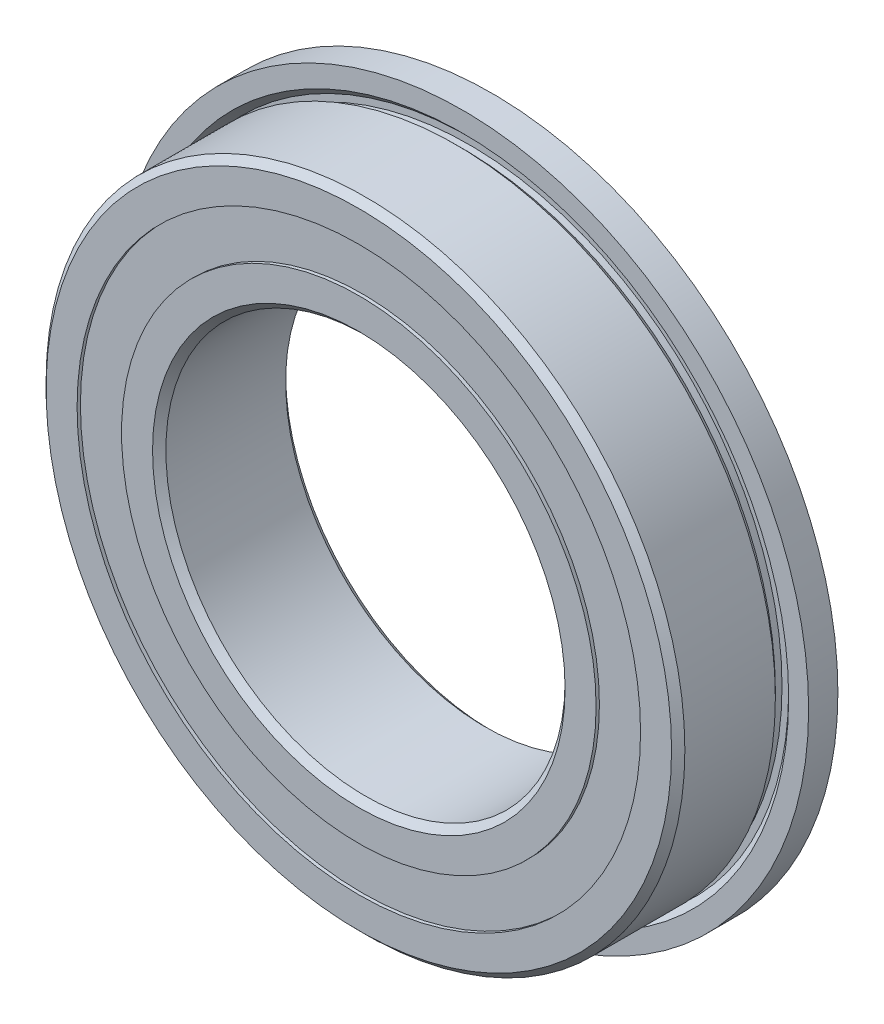
ISO-10303-21;
HEADER;
FILE_DESCRIPTION(('STEP AP214'),'2;1');
FILE_NAME('part.step','',(''),(''),'','','');
FILE_SCHEMA(('AUTOMOTIVE_DESIGN { 1 0 10303 214 1 1 1 1 }'));
ENDSEC;
DATA;
#1=APPLICATION_CONTEXT('core data for automotive mechanical design processes');
#2=APPLICATION_PROTOCOL_DEFINITION('international standard','automotive_design',2000,#1);
#3=PRODUCT_CONTEXT('',#1,'mechanical');
#4=PRODUCT('Part','Part','',(#3));
#5=PRODUCT_RELATED_PRODUCT_CATEGORY('part','',(#4));
#6=PRODUCT_DEFINITION_FORMATION('','',#4);
#7=PRODUCT_DEFINITION_CONTEXT('part definition',#1,'design');
#8=PRODUCT_DEFINITION('design','',#6,#7);
#9=PRODUCT_DEFINITION_SHAPE('','',#8);
#10=(LENGTH_UNIT() NAMED_UNIT(*) SI_UNIT(.MILLI.,.METRE.));
#11=(NAMED_UNIT(*) PLANE_ANGLE_UNIT() SI_UNIT($,.RADIAN.));
#12=(NAMED_UNIT(*) SI_UNIT($,.STERADIAN.) SOLID_ANGLE_UNIT());
#13=UNCERTAINTY_MEASURE_WITH_UNIT(LENGTH_MEASURE(1.E-05),#10,'distance_accuracy_value','');
#14=(GEOMETRIC_REPRESENTATION_CONTEXT(3) GLOBAL_UNCERTAINTY_ASSIGNED_CONTEXT((#13)) GLOBAL_UNIT_ASSIGNED_CONTEXT((#10,
#11,#12)) REPRESENTATION_CONTEXT('',''));
#15=CARTESIAN_POINT('',(0.,0.,0.));
#16=DIRECTION('',(0.,0.,1.));
#17=DIRECTION('',(1.,0.,0.));
#18=AXIS2_PLACEMENT_3D('',#15,#16,#17);
#19=CARTESIAN_POINT('',(0.,10.5851648351648,-2.375));
#20=DIRECTION('',(0.,0.,1.));
#21=DIRECTION('',(1.,0.,0.));
#22=AXIS2_PLACEMENT_3D('',#19,#20,#21);
#23=PLANE('',#22);
#24=CARTESIAN_POINT('',(0.,0.,-2.375));
#25=DIRECTION('',(0.,0.,1.));
#26=DIRECTION('',(1.,0.,0.));
#27=AXIS2_PLACEMENT_3D('',#24,#25,#26);
#28=CIRCLE('',#27,10.5851648351648);
#29=CARTESIAN_POINT('',(10.5851648351648,0.,-2.375));
#30=VERTEX_POINT('',#29);
#31=EDGE_CURVE('E60',#30,#30,#28,.T.);
#32=ORIENTED_EDGE('',*,*,#31,.F.);
#33=EDGE_LOOP('',(#32));
#34=FACE_BOUND('',#33,.T.);
#35=CARTESIAN_POINT('',(0.,0.,-2.375));
#36=DIRECTION('',(0.,0.,1.));
#37=DIRECTION('',(1.,0.,0.));
#38=AXIS2_PLACEMENT_3D('',#35,#36,#37);
#39=CIRCLE('',#38,8.91483516483515);
#40=CARTESIAN_POINT('',(8.91483516483515,0.,-2.375));
#41=VERTEX_POINT('',#40);
#42=EDGE_CURVE('E11',#41,#41,#39,.T.);
#43=ORIENTED_EDGE('',*,*,#42,.T.);
#44=EDGE_LOOP('',(#43));
#45=FACE_BOUND('',#44,.T.);
#46=ADVANCED_FACE('F46',(#34,#45),#23,.F.);
#47=CARTESIAN_POINT('',(0.,0.,2.5));
#48=DIRECTION('',(0.,0.,1.));
#49=DIRECTION('',(1.,0.,0.));
#50=AXIS2_PLACEMENT_3D('',#47,#48,#49);
#51=CYLINDRICAL_SURFACE('',#50,8.91483516483515);
#52=ORIENTED_EDGE('',*,*,#42,.F.);
#53=EDGE_LOOP('',(#52));
#54=FACE_BOUND('',#53,.T.);
#55=CARTESIAN_POINT('',(0.,0.,-1.38998856223009));
#56=DIRECTION('',(0.,0.,1.));
#57=DIRECTION('',(1.,0.,0.));
#58=AXIS2_PLACEMENT_3D('',#55,#56,#57);
#59=CIRCLE('',#58,8.91483516483515);
#60=CARTESIAN_POINT('',(8.91483516483515,0.,-1.38998856223009));
#61=VERTEX_POINT('',#60);
#62=EDGE_CURVE('E52',#61,#61,#59,.T.);
#63=ORIENTED_EDGE('',*,*,#62,.T.);
#64=EDGE_LOOP('',(#63));
#65=FACE_BOUND('',#64,.T.);
#66=ADVANCED_FACE('F69',(#54,#65),#51,.F.);
#67=CARTESIAN_POINT('',(0.,10.5851648351648,-1.38998856223009));
#68=DIRECTION('',(0.,0.,-1.));
#69=DIRECTION('',(-1.,0.,0.));
#70=AXIS2_PLACEMENT_3D('',#67,#68,#69);
#71=PLANE('',#70);
#72=ORIENTED_EDGE('',*,*,#62,.F.);
#73=EDGE_LOOP('',(#72));
#74=FACE_BOUND('',#73,.T.);
#75=CARTESIAN_POINT('',(0.,0.,-1.38998856223009));
#76=DIRECTION('',(0.,0.,1.));
#77=DIRECTION('',(1.,0.,0.));
#78=AXIS2_PLACEMENT_3D('',#75,#76,#77);
#79=CIRCLE('',#78,10.5851648351648);
#80=CARTESIAN_POINT('',(10.5851648351648,0.,-1.38998856223009));
#81=VERTEX_POINT('',#80);
#82=EDGE_CURVE('E56',#81,#81,#79,.T.);
#83=ORIENTED_EDGE('',*,*,#82,.T.);
#84=EDGE_LOOP('',(#83));
#85=FACE_BOUND('',#84,.T.);
#86=ADVANCED_FACE('F73',(#74,#85),#71,.F.);
#87=CARTESIAN_POINT('',(0.,0.,2.5));
#88=DIRECTION('',(0.,0.,1.));
#89=DIRECTION('',(1.,0.,0.));
#90=AXIS2_PLACEMENT_3D('',#87,#88,#89);
#91=CYLINDRICAL_SURFACE('',#90,10.5851648351648);
#92=ORIENTED_EDGE('',*,*,#82,.F.);
#93=EDGE_LOOP('',(#92));
#94=FACE_BOUND('',#93,.T.);
#95=ORIENTED_EDGE('',*,*,#31,.T.);
#96=EDGE_LOOP('',(#95));
#97=FACE_BOUND('',#96,.T.);
#98=ADVANCED_FACE('F66',(#94,#97),#91,.T.);
#99=CLOSED_SHELL('',(#46,#66,#86,#98));
#100=MANIFOLD_SOLID_BREP('B2',#99);
#101=CARTESIAN_POINT('',(0.,10.5851648351648,2.375));
#102=DIRECTION('',(0.,0.,-1.));
#103=DIRECTION('',(-1.,0.,0.));
#104=AXIS2_PLACEMENT_3D('',#101,#102,#103);
#105=PLANE('',#104);
#106=CARTESIAN_POINT('',(0.,0.,2.375));
#107=DIRECTION('',(0.,0.,1.));
#108=DIRECTION('',(1.,0.,0.));
#109=AXIS2_PLACEMENT_3D('',#106,#107,#108);
#110=CIRCLE('',#109,8.91483516483515);
#111=CARTESIAN_POINT('',(8.91483516483515,0.,2.375));
#112=VERTEX_POINT('',#111);
#113=EDGE_CURVE('E45',#112,#112,#110,.T.);
#114=ORIENTED_EDGE('',*,*,#113,.F.);
#115=EDGE_LOOP('',(#114));
#116=FACE_BOUND('',#115,.T.);
#117=CARTESIAN_POINT('',(0.,0.,2.375));
#118=DIRECTION('',(0.,0.,1.));
#119=DIRECTION('',(1.,0.,0.));
#120=AXIS2_PLACEMENT_3D('',#117,#118,#119);
#121=CIRCLE('',#120,10.5851648351648);
#122=CARTESIAN_POINT('',(10.5851648351648,0.,2.375));
#123=VERTEX_POINT('',#122);
#124=EDGE_CURVE('E128',#123,#123,#121,.T.);
#125=ORIENTED_EDGE('',*,*,#124,.T.);
#126=EDGE_LOOP('',(#125));
#127=FACE_BOUND('',#126,.T.);
#128=ADVANCED_FACE('F114',(#116,#127),#105,.F.);
#129=CARTESIAN_POINT('',(0.,0.,2.5));
#130=DIRECTION('',(0.,0.,1.));
#131=DIRECTION('',(1.,0.,0.));
#132=AXIS2_PLACEMENT_3D('',#129,#130,#131);
#133=CYLINDRICAL_SURFACE('',#132,8.91483516483515);
#134=CARTESIAN_POINT('',(0.,0.,1.38998856223009));
#135=DIRECTION('',(0.,0.,1.));
#136=DIRECTION('',(1.,0.,0.));
#137=AXIS2_PLACEMENT_3D('',#134,#135,#136);
#138=CIRCLE('',#137,8.91483516483515);
#139=CARTESIAN_POINT('',(8.91483516483515,0.,1.38998856223009));
#140=VERTEX_POINT('',#139);
#141=EDGE_CURVE('E120',#140,#140,#138,.T.);
#142=ORIENTED_EDGE('',*,*,#141,.F.);
#143=EDGE_LOOP('',(#142));
#144=FACE_BOUND('',#143,.T.);
#145=ORIENTED_EDGE('',*,*,#113,.T.);
#146=EDGE_LOOP('',(#145));
#147=FACE_BOUND('',#146,.T.);
#148=ADVANCED_FACE('F143',(#144,#147),#133,.F.);
#149=CARTESIAN_POINT('',(0.,10.5851648351648,1.38998856223009));
#150=DIRECTION('',(0.,0.,1.));
#151=DIRECTION('',(1.,0.,0.));
#152=AXIS2_PLACEMENT_3D('',#149,#150,#151);
#153=PLANE('',#152);
#154=CARTESIAN_POINT('',(0.,0.,1.38998856223009));
#155=DIRECTION('',(0.,0.,1.));
#156=DIRECTION('',(1.,0.,0.));
#157=AXIS2_PLACEMENT_3D('',#154,#155,#156);
#158=CIRCLE('',#157,10.5851648351648);
#159=CARTESIAN_POINT('',(10.5851648351648,0.,1.38998856223009));
#160=VERTEX_POINT('',#159);
#161=EDGE_CURVE('E124',#160,#160,#158,.T.);
#162=ORIENTED_EDGE('',*,*,#161,.F.);
#163=EDGE_LOOP('',(#162));
#164=FACE_BOUND('',#163,.T.);
#165=ORIENTED_EDGE('',*,*,#141,.T.);
#166=EDGE_LOOP('',(#165));
#167=FACE_BOUND('',#166,.T.);
#168=ADVANCED_FACE('F138',(#164,#167),#153,.F.);
#169=CARTESIAN_POINT('',(0.,0.,2.5));
#170=DIRECTION('',(0.,0.,1.));
#171=DIRECTION('',(1.,0.,0.));
#172=AXIS2_PLACEMENT_3D('',#169,#170,#171);
#173=CYLINDRICAL_SURFACE('',#172,10.5851648351648);
#174=ORIENTED_EDGE('',*,*,#124,.F.);
#175=EDGE_LOOP('',(#174));
#176=FACE_BOUND('',#175,.T.);
#177=ORIENTED_EDGE('',*,*,#161,.T.);
#178=EDGE_LOOP('',(#177));
#179=FACE_BOUND('',#178,.T.);
#180=ADVANCED_FACE('F135',(#176,#179),#173,.T.);
#181=CLOSED_SHELL('',(#128,#148,#168,#180));
#182=MANIFOLD_SOLID_BREP('B6',#181);
#183=CARTESIAN_POINT('',(-4.23036645639608,8.78444646204864,0.));
#184=DIRECTION('',(0.,0.,1.));
#185=DIRECTION('',(-0.433883739117546,0.900968867902425,0.));
#186=AXIS2_PLACEMENT_3D('',#183,#184,#185);
#187=SPHERICAL_SURFACE('',#186,1.38998856223009);
#188=CARTESIAN_POINT('',(-4.23036645639608,8.78444646204864,1.38998856223009));
#189=VERTEX_POINT('',#188);
#190=VERTEX_LOOP('',#189);
#191=FACE_BOUND('',#190,.T.);
#192=ADVANCED_FACE('F182',(#191),#187,.T.);
#193=CLOSED_SHELL('',(#192));
#194=MANIFOLD_SOLID_BREP('B40',#193);
#195=CARTESIAN_POINT('',(-7.62285695406322,6.07902556812275,0.));
#196=DIRECTION('',(0.,0.,1.));
#197=DIRECTION('',(-0.781831482468022,0.623489801858743,0.));
#198=AXIS2_PLACEMENT_3D('',#195,#196,#197);
#199=SPHERICAL_SURFACE('',#198,1.38998856223009);
#200=CARTESIAN_POINT('',(-7.62285695406322,6.07902556812275,1.38998856223009));
#201=VERTEX_POINT('',#200);
#202=VERTEX_LOOP('',#201);
#203=FACE_BOUND('',#202,.T.);
#204=ADVANCED_FACE('F203',(#203),#199,.T.);
#205=CLOSED_SHELL('',(#204));
#206=MANIFOLD_SOLID_BREP('B110',#205);
#207=CARTESIAN_POINT('',(-9.50554714377276,2.16957910607417,0.));
#208=DIRECTION('',(0.,0.,1.));
#209=DIRECTION('',(-0.974927912181821,0.222520933956325,0.));
#210=AXIS2_PLACEMENT_3D('',#207,#208,#209);
#211=SPHERICAL_SURFACE('',#210,1.38998856223009);
#212=CARTESIAN_POINT('',(-9.50554714377276,2.16957910607417,1.38998856223009));
#213=VERTEX_POINT('',#212);
#214=VERTEX_LOOP('',#213);
#215=FACE_BOUND('',#214,.T.);
#216=ADVANCED_FACE('F224',(#215),#211,.T.);
#217=CLOSED_SHELL('',(#216));
#218=MANIFOLD_SOLID_BREP('B178',#217);
#219=CARTESIAN_POINT('',(-9.5055471437728,-2.16957910607397,0.));
#220=DIRECTION('',(0.,0.,1.));
#221=DIRECTION('',(-0.974927912181826,-0.222520933956305,0.));
#222=AXIS2_PLACEMENT_3D('',#219,#220,#221);
#223=SPHERICAL_SURFACE('',#222,1.38998856223009);
#224=CARTESIAN_POINT('',(-9.5055471437728,-2.16957910607397,1.38998856223009));
#225=VERTEX_POINT('',#224);
#226=VERTEX_LOOP('',#225);
#227=FACE_BOUND('',#226,.T.);
#228=ADVANCED_FACE('F245',(#227),#223,.T.);
#229=CLOSED_SHELL('',(#228));
#230=MANIFOLD_SOLID_BREP('B199',#229);
#231=CARTESIAN_POINT('',(-7.62285695406334,-6.07902556812259,0.));
#232=DIRECTION('',(0.,0.,1.));
#233=DIRECTION('',(-0.781831482468035,-0.623489801858727,0.));
#234=AXIS2_PLACEMENT_3D('',#231,#232,#233);
#235=SPHERICAL_SURFACE('',#234,1.38998856223009);
#236=CARTESIAN_POINT('',(-7.62285695406334,-6.07902556812259,1.38998856223009));
#237=VERTEX_POINT('',#236);
#238=VERTEX_LOOP('',#237);
#239=FACE_BOUND('',#238,.T.);
#240=ADVANCED_FACE('F266',(#239),#235,.T.);
#241=CLOSED_SHELL('',(#240));
#242=MANIFOLD_SOLID_BREP('B220',#241);
#243=CARTESIAN_POINT('',(-4.23036645639626,-8.78444646204855,0.));
#244=DIRECTION('',(0.,0.,1.));
#245=DIRECTION('',(-0.433883739117565,-0.900968867902416,0.));
#246=AXIS2_PLACEMENT_3D('',#243,#244,#245);
#247=SPHERICAL_SURFACE('',#246,1.38998856223009);
#248=CARTESIAN_POINT('',(-4.23036645639626,-8.78444646204855,1.38998856223009));
#249=VERTEX_POINT('',#248);
#250=VERTEX_LOOP('',#249);
#251=FACE_BOUND('',#250,.T.);
#252=ADVANCED_FACE('F287',(#251),#247,.T.);
#253=CLOSED_SHELL('',(#252));
#254=MANIFOLD_SOLID_BREP('B241',#253);
#255=CARTESIAN_POINT('',(0.,-9.75,0.));
#256=DIRECTION('',(0.,0.,1.));
#257=DIRECTION('',(0.,-1.,0.));
#258=AXIS2_PLACEMENT_3D('',#255,#256,#257);
#259=SPHERICAL_SURFACE('',#258,1.38998856223009);
#260=CARTESIAN_POINT('',(0.,-9.75,1.38998856223009));
#261=VERTEX_POINT('',#260);
#262=VERTEX_LOOP('',#261);
#263=FACE_BOUND('',#262,.T.);
#264=ADVANCED_FACE('F308',(#263),#259,.T.);
#265=CLOSED_SHELL('',(#264));
#266=MANIFOLD_SOLID_BREP('B262',#265);
#267=CARTESIAN_POINT('',(4.23036645639614,-8.78444646204861,0.));
#268=DIRECTION('',(0.,0.,1.));
#269=DIRECTION('',(0.433883739117553,-0.900968867902422,0.));
#270=AXIS2_PLACEMENT_3D('',#267,#268,#269);
#271=SPHERICAL_SURFACE('',#270,1.38998856223009);
#272=CARTESIAN_POINT('',(4.23036645639614,-8.78444646204861,1.38998856223009));
#273=VERTEX_POINT('',#272);
#274=VERTEX_LOOP('',#273);
#275=FACE_BOUND('',#274,.T.);
#276=ADVANCED_FACE('F329',(#275),#271,.T.);
#277=CLOSED_SHELL('',(#276));
#278=MANIFOLD_SOLID_BREP('B283',#277);
#279=CARTESIAN_POINT('',(7.62285695406326,-6.07902556812269,0.));
#280=DIRECTION('',(0.,0.,1.));
#281=DIRECTION('',(0.781831482468027,-0.623489801858737,0.));
#282=AXIS2_PLACEMENT_3D('',#279,#280,#281);
#283=SPHERICAL_SURFACE('',#282,1.38998856223009);
#284=CARTESIAN_POINT('',(7.62285695406326,-6.07902556812269,1.38998856223009));
#285=VERTEX_POINT('',#284);
#286=VERTEX_LOOP('',#285);
#287=FACE_BOUND('',#286,.T.);
#288=ADVANCED_FACE('F350',(#287),#283,.T.);
#289=CLOSED_SHELL('',(#288));
#290=MANIFOLD_SOLID_BREP('B304',#289);
#291=CARTESIAN_POINT('',(9.50554714377277,-2.1695791060741,0.));
#292=DIRECTION('',(0.,0.,1.));
#293=DIRECTION('',(0.974927912181823,-0.222520933956318,0.));
#294=AXIS2_PLACEMENT_3D('',#291,#292,#293);
#295=SPHERICAL_SURFACE('',#294,1.38998856223009);
#296=CARTESIAN_POINT('',(9.50554714377277,-2.1695791060741,1.38998856223009));
#297=VERTEX_POINT('',#296);
#298=VERTEX_LOOP('',#297);
#299=FACE_BOUND('',#298,.T.);
#300=ADVANCED_FACE('F371',(#299),#295,.T.);
#301=CLOSED_SHELL('',(#300));
#302=MANIFOLD_SOLID_BREP('B325',#301);
#303=CARTESIAN_POINT('',(9.50554714377279,2.16957910607404,0.));
#304=DIRECTION('',(0.,0.,1.));
#305=DIRECTION('',(0.974927912181824,0.222520933956311,0.));
#306=AXIS2_PLACEMENT_3D('',#303,#304,#305);
#307=SPHERICAL_SURFACE('',#306,1.38998856223009);
#308=CARTESIAN_POINT('',(9.50554714377279,2.16957910607404,1.38998856223009));
#309=VERTEX_POINT('',#308);
#310=VERTEX_LOOP('',#309);
#311=FACE_BOUND('',#310,.T.);
#312=ADVANCED_FACE('F392',(#311),#307,.T.);
#313=CLOSED_SHELL('',(#312));
#314=MANIFOLD_SOLID_BREP('B346',#313);
#315=CARTESIAN_POINT('',(7.6228569540633,6.07902556812264,0.));
#316=DIRECTION('',(0.,0.,1.));
#317=DIRECTION('',(0.781831482468031,0.623489801858732,0.));
#318=AXIS2_PLACEMENT_3D('',#315,#316,#317);
#319=SPHERICAL_SURFACE('',#318,1.38998856223009);
#320=CARTESIAN_POINT('',(7.6228569540633,6.07902556812264,1.38998856223009));
#321=VERTEX_POINT('',#320);
#322=VERTEX_LOOP('',#321);
#323=FACE_BOUND('',#322,.T.);
#324=ADVANCED_FACE('F413',(#323),#319,.T.);
#325=CLOSED_SHELL('',(#324));
#326=MANIFOLD_SOLID_BREP('B367',#325);
#327=CARTESIAN_POINT('',(4.2303664563962,8.78444646204858,0.));
#328=DIRECTION('',(0.,0.,1.));
#329=DIRECTION('',(0.433883739117559,0.900968867902419,0.));
#330=AXIS2_PLACEMENT_3D('',#327,#328,#329);
#331=SPHERICAL_SURFACE('',#330,1.38998856223009);
#332=CARTESIAN_POINT('',(4.2303664563962,8.78444646204858,1.38998856223009));
#333=VERTEX_POINT('',#332);
#334=VERTEX_LOOP('',#333);
#335=FACE_BOUND('',#334,.T.);
#336=ADVANCED_FACE('F434',(#335),#331,.T.);
#337=CLOSED_SHELL('',(#336));
#338=MANIFOLD_SOLID_BREP('B388',#337);
#339=CARTESIAN_POINT('',(0.,9.75,0.));
#340=DIRECTION('',(0.,0.,1.));
#341=DIRECTION('',(0.,1.,0.));
#342=AXIS2_PLACEMENT_3D('',#339,#340,#341);
#343=SPHERICAL_SURFACE('',#342,1.38998856223009);
#344=CARTESIAN_POINT('',(0.,9.75,1.38998856223009));
#345=VERTEX_POINT('',#344);
#346=VERTEX_LOOP('',#345);
#347=FACE_BOUND('',#346,.T.);
#348=ADVANCED_FACE('F457',(#347),#343,.T.);
#349=CLOSED_SHELL('',(#348));
#350=MANIFOLD_SOLID_BREP('B409',#349);
#351=CARTESIAN_POINT('',(0.,10.1675824175824,0.139194139194139));
#352=DIRECTION('',(0.,0.,-1.));
#353=DIRECTION('',(-1.,0.,0.));
#354=AXIS2_PLACEMENT_3D('',#351,#352,#353);
#355=PLANE('',#354);
#356=CARTESIAN_POINT('',(0.,0.,0.139194139194139));
#357=DIRECTION('',(0.,0.,1.));
#358=DIRECTION('',(1.,0.,0.));
#359=AXIS2_PLACEMENT_3D('',#356,#357,#358);
#360=CIRCLE('',#359,9.33241758241758);
#361=CARTESIAN_POINT('',(9.33241758241758,0.,0.139194139194139));
#362=VERTEX_POINT('',#361);
#363=EDGE_CURVE('E456',#362,#362,#360,.T.);
#364=ORIENTED_EDGE('',*,*,#363,.F.);
#365=EDGE_LOOP('',(#364));
#366=FACE_BOUND('',#365,.T.);
#367=CARTESIAN_POINT('',(0.,0.,0.139194139194139));
#368=DIRECTION('',(0.,0.,1.));
#369=DIRECTION('',(1.,0.,0.));
#370=AXIS2_PLACEMENT_3D('',#367,#368,#369);
#371=CIRCLE('',#370,10.1675824175824);
#372=CARTESIAN_POINT('',(10.1675824175824,0.,0.139194139194139));
#373=VERTEX_POINT('',#372);
#374=EDGE_CURVE('E492',#373,#373,#371,.T.);
#375=ORIENTED_EDGE('',*,*,#374,.T.);
#376=EDGE_LOOP('',(#375));
#377=FACE_BOUND('',#376,.T.);
#378=ADVANCED_FACE('F478',(#366,#377),#355,.F.);
#379=CARTESIAN_POINT('',(0.,0.,2.5));
#380=DIRECTION('',(0.,0.,1.));
#381=DIRECTION('',(1.,0.,0.));
#382=AXIS2_PLACEMENT_3D('',#379,#380,#381);
#383=CYLINDRICAL_SURFACE('',#382,9.33241758241758);
#384=CARTESIAN_POINT('',(0.,0.,-0.139194139194139));
#385=DIRECTION('',(0.,0.,1.));
#386=DIRECTION('',(1.,0.,0.));
#387=AXIS2_PLACEMENT_3D('',#384,#385,#386);
#388=CIRCLE('',#387,9.33241758241758);
#389=CARTESIAN_POINT('',(9.33241758241758,0.,-0.139194139194139));
#390=VERTEX_POINT('',#389);
#391=EDGE_CURVE('E484',#390,#390,#388,.T.);
#392=ORIENTED_EDGE('',*,*,#391,.F.);
#393=EDGE_LOOP('',(#392));
#394=FACE_BOUND('',#393,.T.);
#395=ORIENTED_EDGE('',*,*,#363,.T.);
#396=EDGE_LOOP('',(#395));
#397=FACE_BOUND('',#396,.T.);
#398=ADVANCED_FACE('F507',(#394,#397),#383,.F.);
#399=CARTESIAN_POINT('',(0.,10.1675824175824,-0.139194139194139));
#400=DIRECTION('',(0.,0.,1.));
#401=DIRECTION('',(1.,0.,0.));
#402=AXIS2_PLACEMENT_3D('',#399,#400,#401);
#403=PLANE('',#402);
#404=CARTESIAN_POINT('',(0.,0.,-0.139194139194139));
#405=DIRECTION('',(0.,0.,1.));
#406=DIRECTION('',(1.,0.,0.));
#407=AXIS2_PLACEMENT_3D('',#404,#405,#406);
#408=CIRCLE('',#407,10.1675824175824);
#409=CARTESIAN_POINT('',(10.1675824175824,0.,-0.139194139194139));
#410=VERTEX_POINT('',#409);
#411=EDGE_CURVE('E488',#410,#410,#408,.T.);
#412=ORIENTED_EDGE('',*,*,#411,.F.);
#413=EDGE_LOOP('',(#412));
#414=FACE_BOUND('',#413,.T.);
#415=ORIENTED_EDGE('',*,*,#391,.T.);
#416=EDGE_LOOP('',(#415));
#417=FACE_BOUND('',#416,.T.);
#418=ADVANCED_FACE('F502',(#414,#417),#403,.F.);
#419=CARTESIAN_POINT('',(0.,0.,2.5));
#420=DIRECTION('',(0.,0.,1.));
#421=DIRECTION('',(1.,0.,0.));
#422=AXIS2_PLACEMENT_3D('',#419,#420,#421);
#423=CYLINDRICAL_SURFACE('',#422,10.1675824175824);
#424=ORIENTED_EDGE('',*,*,#374,.F.);
#425=EDGE_LOOP('',(#424));
#426=FACE_BOUND('',#425,.T.);
#427=ORIENTED_EDGE('',*,*,#411,.T.);
#428=EDGE_LOOP('',(#427));
#429=FACE_BOUND('',#428,.T.);
#430=ADVANCED_FACE('F499',(#426,#429),#423,.T.);
#431=CLOSED_SHELL('',(#378,#398,#418,#430));
#432=MANIFOLD_SOLID_BREP('B430',#431);
#433=CARTESIAN_POINT('',(0.,8.91483516483515,2.5));
#434=DIRECTION('',(0.,0.,-1.));
#435=DIRECTION('',(-1.,0.,0.));
#436=AXIS2_PLACEMENT_3D('',#433,#434,#435);
#437=PLANE('',#436);
#438=CARTESIAN_POINT('',(0.,0.,2.5));
#439=DIRECTION('',(0.,0.,1.));
#440=DIRECTION('',(1.,0.,0.));
#441=AXIS2_PLACEMENT_3D('',#438,#439,#440);
#442=CIRCLE('',#441,7.75);
#443=CARTESIAN_POINT('',(7.75,0.,2.5));
#444=VERTEX_POINT('',#443);
#445=EDGE_CURVE('E575',#444,#444,#442,.T.);
#446=ORIENTED_EDGE('',*,*,#445,.F.);
#447=EDGE_LOOP('',(#446));
#448=FACE_BOUND('',#447,.T.);
#449=CARTESIAN_POINT('',(0.,0.,2.5));
#450=DIRECTION('',(0.,0.,1.));
#451=DIRECTION('',(1.,0.,0.));
#452=AXIS2_PLACEMENT_3D('',#449,#450,#451);
#453=CIRCLE('',#452,8.91483516483515);
#454=CARTESIAN_POINT('',(8.91483516483515,0.,2.5));
#455=VERTEX_POINT('',#454);
#456=EDGE_CURVE('E477',#455,#455,#453,.T.);
#457=ORIENTED_EDGE('',*,*,#456,.T.);
#458=EDGE_LOOP('',(#457));
#459=FACE_BOUND('',#458,.T.);
#460=ADVANCED_FACE('F547',(#448,#459),#437,.F.);
#461=CARTESIAN_POINT('',(0.,0.,2.5));
#462=DIRECTION('',(0.,0.,1.));
#463=DIRECTION('',(1.,0.,0.));
#464=AXIS2_PLACEMENT_3D('',#461,#462,#463);
#465=CYLINDRICAL_SURFACE('',#464,8.91483516483515);
#466=ORIENTED_EDGE('',*,*,#456,.F.);
#467=EDGE_LOOP('',(#466));
#468=FACE_BOUND('',#467,.T.);
#469=CARTESIAN_POINT('',(0.,0.,1.11111111111111));
#470=DIRECTION('',(0.,0.,1.));
#471=DIRECTION('',(1.,0.,0.));
#472=AXIS2_PLACEMENT_3D('',#469,#470,#471);
#473=CIRCLE('',#472,8.91483516483515);
#474=CARTESIAN_POINT('',(8.91483516483515,0.,1.11111111111111));
#475=VERTEX_POINT('',#474);
#476=EDGE_CURVE('E553',#475,#475,#473,.T.);
#477=ORIENTED_EDGE('',*,*,#476,.T.);
#478=EDGE_LOOP('',(#477));
#479=FACE_BOUND('',#478,.T.);
#480=ADVANCED_FACE('F582',(#468,#479),#465,.T.);
#481=CARTESIAN_POINT('',(0.,0.,0.));
#482=DIRECTION('',(0.,0.,1.));
#483=DIRECTION('',(1.,0.,0.));
#484=AXIS2_PLACEMENT_3D('',#481,#482,#483);
#485=TOROIDAL_SURFACE('',#484,9.74999999999998,1.38998856223009);
#486=ORIENTED_EDGE('',*,*,#476,.F.);
#487=EDGE_LOOP('',(#486));
#488=FACE_BOUND('',#487,.T.);
#489=CARTESIAN_POINT('',(0.,0.,-1.11111111111111));
#490=DIRECTION('',(0.,0.,1.));
#491=DIRECTION('',(1.,0.,0.));
#492=AXIS2_PLACEMENT_3D('',#489,#490,#491);
#493=CIRCLE('',#492,8.91483516483515);
#494=CARTESIAN_POINT('',(8.91483516483515,0.,-1.11111111111111));
#495=VERTEX_POINT('',#494);
#496=EDGE_CURVE('E557',#495,#495,#493,.T.);
#497=ORIENTED_EDGE('',*,*,#496,.T.);
#498=EDGE_LOOP('',(#497));
#499=FACE_BOUND('',#498,.T.);
#500=ADVANCED_FACE('F586',(#488,#499),#485,.F.);
#501=CARTESIAN_POINT('',(0.,0.,2.5));
#502=DIRECTION('',(0.,0.,1.));
#503=DIRECTION('',(1.,0.,0.));
#504=AXIS2_PLACEMENT_3D('',#501,#502,#503);
#505=CYLINDRICAL_SURFACE('',#504,8.91483516483515);
#506=ORIENTED_EDGE('',*,*,#496,.F.);
#507=EDGE_LOOP('',(#506));
#508=FACE_BOUND('',#507,.T.);
#509=CARTESIAN_POINT('',(0.,0.,-2.5));
#510=DIRECTION('',(0.,0.,1.));
#511=DIRECTION('',(1.,0.,0.));
#512=AXIS2_PLACEMENT_3D('',#509,#510,#511);
#513=CIRCLE('',#512,8.91483516483515);
#514=CARTESIAN_POINT('',(8.91483516483515,0.,-2.5));
#515=VERTEX_POINT('',#514);
#516=EDGE_CURVE('E561',#515,#515,#513,.T.);
#517=ORIENTED_EDGE('',*,*,#516,.T.);
#518=EDGE_LOOP('',(#517));
#519=FACE_BOUND('',#518,.T.);
#520=ADVANCED_FACE('F591',(#508,#519),#505,.T.);
#521=CARTESIAN_POINT('',(0.,7.75000000000001,-2.5));
#522=DIRECTION('',(0.,0.,1.));
#523=DIRECTION('',(1.,0.,0.));
#524=AXIS2_PLACEMENT_3D('',#521,#522,#523);
#525=PLANE('',#524);
#526=ORIENTED_EDGE('',*,*,#516,.F.);
#527=EDGE_LOOP('',(#526));
#528=FACE_BOUND('',#527,.T.);
#529=CARTESIAN_POINT('',(0.,0.,-2.5));
#530=DIRECTION('',(0.,0.,1.));
#531=DIRECTION('',(1.,0.,0.));
#532=AXIS2_PLACEMENT_3D('',#529,#530,#531);
#533=CIRCLE('',#532,7.75000000000001);
#534=CARTESIAN_POINT('',(7.75000000000001,0.,-2.5));
#535=VERTEX_POINT('',#534);
#536=EDGE_CURVE('E566',#535,#535,#533,.T.);
#537=ORIENTED_EDGE('',*,*,#536,.T.);
#538=EDGE_LOOP('',(#537));
#539=FACE_BOUND('',#538,.T.);
#540=ADVANCED_FACE('F597',(#528,#539),#525,.F.);
#541=CARTESIAN_POINT('',(0.,0.,-2.25));
#542=DIRECTION('',(0.,0.,-1.));
#543=DIRECTION('',(-1.,0.,0.));
#544=AXIS2_PLACEMENT_3D('',#541,#542,#543);
#545=CONICAL_SURFACE('',#544,7.5,0.785398163397476);
#546=ORIENTED_EDGE('',*,*,#536,.F.);
#547=EDGE_LOOP('',(#546));
#548=FACE_BOUND('',#547,.T.);
#549=CARTESIAN_POINT('',(0.,0.,-2.25));
#550=DIRECTION('',(0.,0.,1.));
#551=DIRECTION('',(1.,0.,0.));
#552=AXIS2_PLACEMENT_3D('',#549,#550,#551);
#553=CIRCLE('',#552,7.5);
#554=CARTESIAN_POINT('',(7.5,0.,-2.25));
#555=VERTEX_POINT('',#554);
#556=EDGE_CURVE('E569',#555,#555,#553,.T.);
#557=ORIENTED_EDGE('',*,*,#556,.T.);
#558=EDGE_LOOP('',(#557));
#559=FACE_BOUND('',#558,.T.);
#560=ADVANCED_FACE('F601',(#548,#559),#545,.F.);
#561=CARTESIAN_POINT('',(0.,0.,2.5));
#562=DIRECTION('',(0.,0.,1.));
#563=DIRECTION('',(1.,0.,0.));
#564=AXIS2_PLACEMENT_3D('',#561,#562,#563);
#565=CYLINDRICAL_SURFACE('',#564,7.5);
#566=ORIENTED_EDGE('',*,*,#556,.F.);
#567=EDGE_LOOP('',(#566));
#568=FACE_BOUND('',#567,.T.);
#569=CARTESIAN_POINT('',(0.,0.,2.24999999999998));
#570=DIRECTION('',(0.,0.,1.));
#571=DIRECTION('',(1.,0.,0.));
#572=AXIS2_PLACEMENT_3D('',#569,#570,#571);
#573=CIRCLE('',#572,7.5);
#574=CARTESIAN_POINT('',(7.5,0.,2.24999999999998));
#575=VERTEX_POINT('',#574);
#576=EDGE_CURVE('E572',#575,#575,#573,.T.);
#577=ORIENTED_EDGE('',*,*,#576,.T.);
#578=EDGE_LOOP('',(#577));
#579=FACE_BOUND('',#578,.T.);
#580=ADVANCED_FACE('F605',(#568,#579),#565,.F.);
#581=CARTESIAN_POINT('',(0.,0.,2.5));
#582=DIRECTION('',(0.,0.,1.));
#583=DIRECTION('',(1.,0.,0.));
#584=AXIS2_PLACEMENT_3D('',#581,#582,#583);
#585=CONICAL_SURFACE('',#584,7.75,0.78539816339742);
#586=ORIENTED_EDGE('',*,*,#576,.F.);
#587=EDGE_LOOP('',(#586));
#588=FACE_BOUND('',#587,.T.);
#589=ORIENTED_EDGE('',*,*,#445,.T.);
#590=EDGE_LOOP('',(#589));
#591=FACE_BOUND('',#590,.T.);
#592=ADVANCED_FACE('F579',(#588,#591),#585,.F.);
#593=CLOSED_SHELL('',(#460,#480,#500,#520,#540,#560,#580,#592));
#594=MANIFOLD_SOLID_BREP('B451',#593);
#595=CARTESIAN_POINT('',(0.,0.,2.5));
#596=DIRECTION('',(0.,0.,1.));
#597=DIRECTION('',(1.,0.,0.));
#598=AXIS2_PLACEMENT_3D('',#595,#596,#597);
#599=CYLINDRICAL_SURFACE('',#598,12.);
#600=CARTESIAN_POINT('',(0.,0.,2.25));
#601=DIRECTION('',(0.,0.,1.));
#602=DIRECTION('',(1.,0.,0.));
#603=AXIS2_PLACEMENT_3D('',#600,#601,#602);
#604=CIRCLE('',#603,12.);
#605=CARTESIAN_POINT('',(12.,0.,2.25));
#606=VERTEX_POINT('',#605);
#607=EDGE_CURVE('E712',#606,#606,#604,.T.);
#608=ORIENTED_EDGE('',*,*,#607,.F.);
#609=EDGE_LOOP('',(#608));
#610=FACE_BOUND('',#609,.T.);
#611=CARTESIAN_POINT('',(0.,0.,-1.14999999999999));
#612=DIRECTION('',(0.,0.,1.));
#613=DIRECTION('',(1.,0.,0.));
#614=AXIS2_PLACEMENT_3D('',#611,#612,#613);
#615=CIRCLE('',#614,12.);
#616=CARTESIAN_POINT('',(12.,0.,-1.14999999999999));
#617=VERTEX_POINT('',#616);
#618=EDGE_CURVE('E546',#617,#617,#615,.T.);
#619=ORIENTED_EDGE('',*,*,#618,.T.);
#620=EDGE_LOOP('',(#619));
#621=FACE_BOUND('',#620,.T.);
#622=ADVANCED_FACE('F669',(#610,#621),#599,.T.);
#623=CARTESIAN_POINT('',(0.,0.,-1.4));
#624=DIRECTION('',(0.,0.,1.));
#625=DIRECTION('',(1.,0.,0.));
#626=AXIS2_PLACEMENT_3D('',#623,#624,#625);
#627=CONICAL_SURFACE('',#626,11.75,0.785398163397427);
#628=ORIENTED_EDGE('',*,*,#618,.F.);
#629=EDGE_LOOP('',(#628));
#630=FACE_BOUND('',#629,.T.);
#631=CARTESIAN_POINT('',(0.,0.,-1.4));
#632=DIRECTION('',(0.,0.,1.));
#633=DIRECTION('',(1.,0.,0.));
#634=AXIS2_PLACEMENT_3D('',#631,#632,#633);
#635=CIRCLE('',#634,11.75);
#636=CARTESIAN_POINT('',(11.75,0.,-1.4));
#637=VERTEX_POINT('',#636);
#638=EDGE_CURVE('E675',#637,#637,#635,.T.);
#639=ORIENTED_EDGE('',*,*,#638,.T.);
#640=EDGE_LOOP('',(#639));
#641=FACE_BOUND('',#640,.T.);
#642=ADVANCED_FACE('F719',(#630,#641),#627,.T.);
#643=CARTESIAN_POINT('',(0.,0.,2.5));
#644=DIRECTION('',(0.,0.,1.));
#645=DIRECTION('',(1.,0.,0.));
#646=AXIS2_PLACEMENT_3D('',#643,#644,#645);
#647=CYLINDRICAL_SURFACE('',#646,11.75);
#648=ORIENTED_EDGE('',*,*,#638,.F.);
#649=EDGE_LOOP('',(#648));
#650=FACE_BOUND('',#649,.T.);
#651=CARTESIAN_POINT('',(0.,0.,-1.65));
#652=DIRECTION('',(0.,0.,1.));
#653=DIRECTION('',(1.,0.,0.));
#654=AXIS2_PLACEMENT_3D('',#651,#652,#653);
#655=CIRCLE('',#654,11.75);
#656=CARTESIAN_POINT('',(11.75,0.,-1.65));
#657=VERTEX_POINT('',#656);
#658=EDGE_CURVE('E679',#657,#657,#655,.T.);
#659=ORIENTED_EDGE('',*,*,#658,.T.);
#660=EDGE_LOOP('',(#659));
#661=FACE_BOUND('',#660,.T.);
#662=ADVANCED_FACE('F723',(#650,#661),#647,.T.);
#663=CARTESIAN_POINT('',(0.,12.,-1.65));
#664=DIRECTION('',(0.,0.,-1.));
#665=DIRECTION('',(-1.,0.,0.));
#666=AXIS2_PLACEMENT_3D('',#663,#664,#665);
#667=PLANE('',#666);
#668=ORIENTED_EDGE('',*,*,#658,.F.);
#669=EDGE_LOOP('',(#668));
#670=FACE_BOUND('',#669,.T.);
#671=CARTESIAN_POINT('',(0.,0.,-1.65));
#672=DIRECTION('',(0.,0.,1.));
#673=DIRECTION('',(1.,0.,0.));
#674=AXIS2_PLACEMENT_3D('',#671,#672,#673);
#675=CIRCLE('',#674,12.);
#676=CARTESIAN_POINT('',(12.,0.,-1.65));
#677=VERTEX_POINT('',#676);
#678=EDGE_CURVE('E683',#677,#677,#675,.T.);
#679=ORIENTED_EDGE('',*,*,#678,.T.);
#680=EDGE_LOOP('',(#679));
#681=FACE_BOUND('',#680,.T.);
#682=ADVANCED_FACE('F728',(#670,#681),#667,.F.);
#683=CARTESIAN_POINT('',(0.,0.,-1.4));
#684=DIRECTION('',(0.,0.,1.));
#685=DIRECTION('',(1.,0.,0.));
#686=AXIS2_PLACEMENT_3D('',#683,#684,#685);
#687=CONICAL_SURFACE('',#686,12.25,0.785398163397444);
#688=ORIENTED_EDGE('',*,*,#678,.F.);
#689=EDGE_LOOP('',(#688));
#690=FACE_BOUND('',#689,.T.);
#691=CARTESIAN_POINT('',(0.,0.,-1.4));
#692=DIRECTION('',(0.,0.,1.));
#693=DIRECTION('',(1.,0.,0.));
#694=AXIS2_PLACEMENT_3D('',#691,#692,#693);
#695=CIRCLE('',#694,12.25);
#696=CARTESIAN_POINT('',(12.25,0.,-1.4));
#697=VERTEX_POINT('',#696);
#698=EDGE_CURVE('E688',#697,#697,#695,.T.);
#699=ORIENTED_EDGE('',*,*,#698,.T.);
#700=EDGE_LOOP('',(#699));
#701=FACE_BOUND('',#700,.T.);
#702=ADVANCED_FACE('F734',(#690,#701),#687,.F.);
#703=CARTESIAN_POINT('',(0.,13.,-1.4));
#704=DIRECTION('',(0.,0.,-1.));
#705=DIRECTION('',(-1.,0.,0.));
#706=AXIS2_PLACEMENT_3D('',#703,#704,#705);
#707=PLANE('',#706);
#708=ORIENTED_EDGE('',*,*,#698,.F.);
#709=EDGE_LOOP('',(#708));
#710=FACE_BOUND('',#709,.T.);
#711=CARTESIAN_POINT('',(0.,0.,-1.4));
#712=DIRECTION('',(0.,0.,1.));
#713=DIRECTION('',(1.,0.,0.));
#714=AXIS2_PLACEMENT_3D('',#711,#712,#713);
#715=CIRCLE('',#714,13.);
#716=CARTESIAN_POINT('',(13.,0.,-1.4));
#717=VERTEX_POINT('',#716);
#718=EDGE_CURVE('E691',#717,#717,#715,.T.);
#719=ORIENTED_EDGE('',*,*,#718,.T.);
#720=EDGE_LOOP('',(#719));
#721=FACE_BOUND('',#720,.T.);
#722=ADVANCED_FACE('F738',(#710,#721),#707,.F.);
#723=CARTESIAN_POINT('',(0.,0.,2.5));
#724=DIRECTION('',(0.,0.,1.));
#725=DIRECTION('',(1.,0.,0.));
#726=AXIS2_PLACEMENT_3D('',#723,#724,#725);
#727=CYLINDRICAL_SURFACE('',#726,13.);
#728=ORIENTED_EDGE('',*,*,#718,.F.);
#729=EDGE_LOOP('',(#728));
#730=FACE_BOUND('',#729,.T.);
#731=CARTESIAN_POINT('',(0.,0.,-2.5));
#732=DIRECTION('',(0.,0.,1.));
#733=DIRECTION('',(1.,0.,0.));
#734=AXIS2_PLACEMENT_3D('',#731,#732,#733);
#735=CIRCLE('',#734,13.);
#736=CARTESIAN_POINT('',(13.,0.,-2.5));
#737=VERTEX_POINT('',#736);
#738=EDGE_CURVE('E694',#737,#737,#735,.T.);
#739=ORIENTED_EDGE('',*,*,#738,.T.);
#740=EDGE_LOOP('',(#739));
#741=FACE_BOUND('',#740,.T.);
#742=ADVANCED_FACE('F742',(#730,#741),#727,.T.);
#743=CARTESIAN_POINT('',(0.,11.75,-2.5));
#744=DIRECTION('',(0.,0.,1.));
#745=DIRECTION('',(1.,0.,0.));
#746=AXIS2_PLACEMENT_3D('',#743,#744,#745);
#747=PLANE('',#746);
#748=ORIENTED_EDGE('',*,*,#738,.F.);
#749=EDGE_LOOP('',(#748));
#750=FACE_BOUND('',#749,.T.);
#751=CARTESIAN_POINT('',(0.,0.,-2.5));
#752=DIRECTION('',(0.,0.,1.));
#753=DIRECTION('',(1.,0.,0.));
#754=AXIS2_PLACEMENT_3D('',#751,#752,#753);
#755=CIRCLE('',#754,10.5851648351648);
#756=CARTESIAN_POINT('',(10.5851648351648,0.,-2.5));
#757=VERTEX_POINT('',#756);
#758=EDGE_CURVE('E697',#757,#757,#755,.T.);
#759=ORIENTED_EDGE('',*,*,#758,.T.);
#760=EDGE_LOOP('',(#759));
#761=FACE_BOUND('',#760,.T.);
#762=ADVANCED_FACE('F746',(#750,#761),#747,.F.);
#763=CARTESIAN_POINT('',(0.,0.,2.5));
#764=DIRECTION('',(0.,0.,1.));
#765=DIRECTION('',(1.,0.,0.));
#766=AXIS2_PLACEMENT_3D('',#763,#764,#765);
#767=CYLINDRICAL_SURFACE('',#766,10.5851648351648);
#768=ORIENTED_EDGE('',*,*,#758,.F.);
#769=EDGE_LOOP('',(#768));
#770=FACE_BOUND('',#769,.T.);
#771=CARTESIAN_POINT('',(0.,0.,-1.11111111111111));
#772=DIRECTION('',(0.,0.,1.));
#773=DIRECTION('',(1.,0.,0.));
#774=AXIS2_PLACEMENT_3D('',#771,#772,#773);
#775=CIRCLE('',#774,10.5851648351648);
#776=CARTESIAN_POINT('',(10.5851648351648,0.,-1.11111111111111));
#777=VERTEX_POINT('',#776);
#778=EDGE_CURVE('E700',#777,#777,#775,.T.);
#779=ORIENTED_EDGE('',*,*,#778,.T.);
#780=EDGE_LOOP('',(#779));
#781=FACE_BOUND('',#780,.T.);
#782=ADVANCED_FACE('F750',(#770,#781),#767,.F.);
#783=CARTESIAN_POINT('',(0.,0.,0.));
#784=DIRECTION('',(0.,0.,1.));
#785=DIRECTION('',(1.,0.,0.));
#786=AXIS2_PLACEMENT_3D('',#783,#784,#785);
#787=TOROIDAL_SURFACE('',#786,9.75,1.38998856223009);
#788=ORIENTED_EDGE('',*,*,#778,.F.);
#789=EDGE_LOOP('',(#788));
#790=FACE_BOUND('',#789,.T.);
#791=CARTESIAN_POINT('',(0.,0.,1.11111111111111));
#792=DIRECTION('',(0.,0.,1.));
#793=DIRECTION('',(1.,0.,0.));
#794=AXIS2_PLACEMENT_3D('',#791,#792,#793);
#795=CIRCLE('',#794,10.5851648351648);
#796=CARTESIAN_POINT('',(10.5851648351648,0.,1.11111111111111));
#797=VERTEX_POINT('',#796);
#798=EDGE_CURVE('E703',#797,#797,#795,.T.);
#799=ORIENTED_EDGE('',*,*,#798,.T.);
#800=EDGE_LOOP('',(#799));
#801=FACE_BOUND('',#800,.T.);
#802=ADVANCED_FACE('F754',(#790,#801),#787,.F.);
#803=CARTESIAN_POINT('',(0.,0.,2.5));
#804=DIRECTION('',(0.,0.,1.));
#805=DIRECTION('',(1.,0.,0.));
#806=AXIS2_PLACEMENT_3D('',#803,#804,#805);
#807=CYLINDRICAL_SURFACE('',#806,10.5851648351648);
#808=ORIENTED_EDGE('',*,*,#798,.F.);
#809=EDGE_LOOP('',(#808));
#810=FACE_BOUND('',#809,.T.);
#811=CARTESIAN_POINT('',(0.,0.,2.5));
#812=DIRECTION('',(0.,0.,1.));
#813=DIRECTION('',(1.,0.,0.));
#814=AXIS2_PLACEMENT_3D('',#811,#812,#813);
#815=CIRCLE('',#814,10.5851648351648);
#816=CARTESIAN_POINT('',(10.5851648351648,0.,2.5));
#817=VERTEX_POINT('',#816);
#818=EDGE_CURVE('E706',#817,#817,#815,.T.);
#819=ORIENTED_EDGE('',*,*,#818,.T.);
#820=EDGE_LOOP('',(#819));
#821=FACE_BOUND('',#820,.T.);
#822=ADVANCED_FACE('F758',(#810,#821),#807,.F.);
#823=CARTESIAN_POINT('',(0.,11.75,2.5));
#824=DIRECTION('',(0.,0.,-1.));
#825=DIRECTION('',(-1.,0.,0.));
#826=AXIS2_PLACEMENT_3D('',#823,#824,#825);
#827=PLANE('',#826);
#828=ORIENTED_EDGE('',*,*,#818,.F.);
#829=EDGE_LOOP('',(#828));
#830=FACE_BOUND('',#829,.T.);
#831=CARTESIAN_POINT('',(0.,0.,2.5));
#832=DIRECTION('',(0.,0.,1.));
#833=DIRECTION('',(1.,0.,0.));
#834=AXIS2_PLACEMENT_3D('',#831,#832,#833);
#835=CIRCLE('',#834,11.75);
#836=CARTESIAN_POINT('',(11.75,0.,2.5));
#837=VERTEX_POINT('',#836);
#838=EDGE_CURVE('E709',#837,#837,#835,.T.);
#839=ORIENTED_EDGE('',*,*,#838,.T.);
#840=EDGE_LOOP('',(#839));
#841=FACE_BOUND('',#840,.T.);
#842=ADVANCED_FACE('F762',(#830,#841),#827,.F.);
#843=CARTESIAN_POINT('',(0.,0.,2.25));
#844=DIRECTION('',(0.,0.,-1.));
#845=DIRECTION('',(-1.,0.,0.));
#846=AXIS2_PLACEMENT_3D('',#843,#844,#845);
#847=CONICAL_SURFACE('',#846,12.,0.785398163397476);
#848=ORIENTED_EDGE('',*,*,#838,.F.);
#849=EDGE_LOOP('',(#848));
#850=FACE_BOUND('',#849,.T.);
#851=ORIENTED_EDGE('',*,*,#607,.T.);
#852=EDGE_LOOP('',(#851));
#853=FACE_BOUND('',#852,.T.);
#854=ADVANCED_FACE('F716',(#850,#853),#847,.T.);
#855=CLOSED_SHELL('',(#622,#642,#662,#682,#702,#722,#742,#762,#782,#802,#822,#842,#854));
#856=MANIFOLD_SOLID_BREP('B472',#855);
#857=ADVANCED_BREP_SHAPE_REPRESENTATION('',(#18,#100,#182,#194,#206,#218,#230,#242,#254,#266,
#278,#290,#302,#314,#326,#338,#350,#432,#594,#856),#14);
#858=SHAPE_DEFINITION_REPRESENTATION(#9,#857);
ENDSEC;
END-ISO-10303-21;
